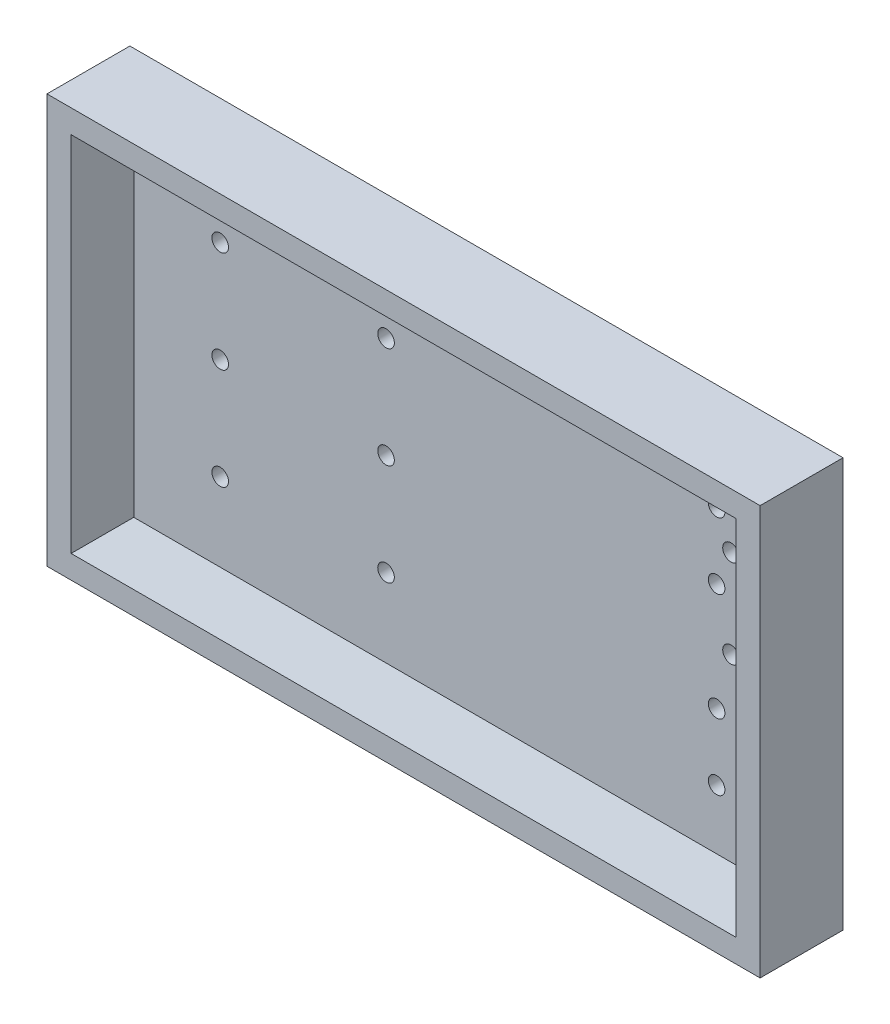
ISO-10303-21;
HEADER;
FILE_DESCRIPTION(('STEP AP214'),'2;1');
FILE_NAME('part.step','',(''),(''),'','','');
FILE_SCHEMA(('AUTOMOTIVE_DESIGN { 1 0 10303 214 1 1 1 1 }'));
ENDSEC;
DATA;
#1=APPLICATION_CONTEXT('core data for automotive mechanical design processes');
#2=APPLICATION_PROTOCOL_DEFINITION('international standard','automotive_design',2000,#1);
#3=PRODUCT_CONTEXT('',#1,'mechanical');
#4=PRODUCT('Part','Part','',(#3));
#5=PRODUCT_RELATED_PRODUCT_CATEGORY('part','',(#4));
#6=PRODUCT_DEFINITION_FORMATION('','',#4);
#7=PRODUCT_DEFINITION_CONTEXT('part definition',#1,'design');
#8=PRODUCT_DEFINITION('design','',#6,#7);
#9=PRODUCT_DEFINITION_SHAPE('','',#8);
#10=(LENGTH_UNIT() NAMED_UNIT(*) SI_UNIT(.MILLI.,.METRE.));
#11=(NAMED_UNIT(*) PLANE_ANGLE_UNIT() SI_UNIT($,.RADIAN.));
#12=(NAMED_UNIT(*) SI_UNIT($,.STERADIAN.) SOLID_ANGLE_UNIT());
#13=UNCERTAINTY_MEASURE_WITH_UNIT(LENGTH_MEASURE(1.E-05),#10,'distance_accuracy_value','');
#14=(GEOMETRIC_REPRESENTATION_CONTEXT(3) GLOBAL_UNCERTAINTY_ASSIGNED_CONTEXT((#13)) GLOBAL_UNIT_ASSIGNED_CONTEXT((#10,
#11,#12)) REPRESENTATION_CONTEXT('',''));
#15=CARTESIAN_POINT('',(0.,0.,0.));
#16=DIRECTION('',(0.,0.,1.));
#17=DIRECTION('',(1.,0.,0.));
#18=AXIS2_PLACEMENT_3D('',#15,#16,#17);
#19=CARTESIAN_POINT('',(50.3,37.,-29.));
#20=DIRECTION('',(0.,0.,-1.));
#21=DIRECTION('',(-1.,0.,0.));
#22=AXIS2_PLACEMENT_3D('',#19,#20,#21);
#23=CYLINDRICAL_SURFACE('',#22,1.5);
#24=CARTESIAN_POINT('',(50.3,37.,-39.));
#25=DIRECTION('',(0.,0.,-1.));
#26=DIRECTION('',(-1.,0.,0.));
#27=AXIS2_PLACEMENT_3D('',#24,#25,#26);
#28=CIRCLE('',#27,1.5);
#29=CARTESIAN_POINT('',(48.8,37.,-39.));
#30=VERTEX_POINT('',#29);
#31=EDGE_CURVE('E215',#30,#30,#28,.T.);
#32=ORIENTED_EDGE('',*,*,#31,.T.);
#33=EDGE_LOOP('',(#32));
#34=FACE_BOUND('',#33,.T.);
#35=CARTESIAN_POINT('',(50.3,37.,-35.035));
#36=DIRECTION('',(0.,0.,1.));
#37=DIRECTION('',(1.,0.,0.));
#38=AXIS2_PLACEMENT_3D('',#35,#36,#37);
#39=CIRCLE('',#38,1.5);
#40=CARTESIAN_POINT('',(51.8,37.,-35.035));
#41=VERTEX_POINT('',#40);
#42=EDGE_CURVE('E187',#41,#41,#39,.F.);
#43=ORIENTED_EDGE('',*,*,#42,.F.);
#44=EDGE_LOOP('',(#43));
#45=FACE_BOUND('',#44,.T.);
#46=ADVANCED_FACE('F32',(#34,#45),#23,.F.);
#47=CARTESIAN_POINT('',(110.1,46.75,-29.));
#48=DIRECTION('',(0.,0.,-1.));
#49=DIRECTION('',(-1.,0.,0.));
#50=AXIS2_PLACEMENT_3D('',#47,#48,#49);
#51=CYLINDRICAL_SURFACE('',#50,1.5);
#52=CARTESIAN_POINT('',(110.1,46.75,-39.));
#53=DIRECTION('',(0.,0.,-1.));
#54=DIRECTION('',(-1.,0.,0.));
#55=AXIS2_PLACEMENT_3D('',#52,#53,#54);
#56=CIRCLE('',#55,1.5);
#57=CARTESIAN_POINT('',(108.6,46.75,-39.));
#58=VERTEX_POINT('',#57);
#59=EDGE_CURVE('E194',#58,#58,#56,.T.);
#60=ORIENTED_EDGE('',*,*,#59,.T.);
#61=EDGE_LOOP('',(#60));
#62=FACE_BOUND('',#61,.T.);
#63=CARTESIAN_POINT('',(110.1,46.75,-35.035));
#64=DIRECTION('',(0.,0.,1.));
#65=DIRECTION('',(1.,0.,0.));
#66=AXIS2_PLACEMENT_3D('',#63,#64,#65);
#67=CIRCLE('',#66,1.5);
#68=CARTESIAN_POINT('',(111.6,46.75,-35.035));
#69=VERTEX_POINT('',#68);
#70=EDGE_CURVE('E184',#69,#69,#67,.F.);
#71=ORIENTED_EDGE('',*,*,#70,.F.);
#72=EDGE_LOOP('',(#71));
#73=FACE_BOUND('',#72,.T.);
#74=ADVANCED_FACE('F264',(#62,#73),#51,.F.);
#75=CARTESIAN_POINT('',(110.1,15.25,-29.));
#76=DIRECTION('',(0.,0.,-1.));
#77=DIRECTION('',(-1.,0.,0.));
#78=AXIS2_PLACEMENT_3D('',#75,#76,#77);
#79=CYLINDRICAL_SURFACE('',#78,1.5);
#80=CARTESIAN_POINT('',(110.1,15.25,-39.));
#81=DIRECTION('',(0.,0.,-1.));
#82=DIRECTION('',(-1.,0.,0.));
#83=AXIS2_PLACEMENT_3D('',#80,#81,#82);
#84=CIRCLE('',#83,1.5);
#85=CARTESIAN_POINT('',(108.6,15.25,-39.));
#86=VERTEX_POINT('',#85);
#87=EDGE_CURVE('E193',#86,#86,#84,.T.);
#88=ORIENTED_EDGE('',*,*,#87,.T.);
#89=EDGE_LOOP('',(#88));
#90=FACE_BOUND('',#89,.T.);
#91=CARTESIAN_POINT('',(110.1,15.25,-35.035));
#92=DIRECTION('',(0.,0.,1.));
#93=DIRECTION('',(1.,0.,0.));
#94=AXIS2_PLACEMENT_3D('',#91,#92,#93);
#95=CIRCLE('',#94,1.5);
#96=CARTESIAN_POINT('',(111.6,15.25,-35.035));
#97=VERTEX_POINT('',#96);
#98=EDGE_CURVE('E181',#97,#97,#95,.F.);
#99=ORIENTED_EDGE('',*,*,#98,.F.);
#100=EDGE_LOOP('',(#99));
#101=FACE_BOUND('',#100,.T.);
#102=ADVANCED_FACE('F270',(#90,#101),#79,.F.);
#103=CARTESIAN_POINT('',(110.1,27.25,-29.));
#104=DIRECTION('',(0.,0.,-1.));
#105=DIRECTION('',(-1.,0.,0.));
#106=AXIS2_PLACEMENT_3D('',#103,#104,#105);
#107=CYLINDRICAL_SURFACE('',#106,1.5);
#108=CARTESIAN_POINT('',(110.1,27.25,-39.));
#109=DIRECTION('',(0.,0.,-1.));
#110=DIRECTION('',(-1.,0.,0.));
#111=AXIS2_PLACEMENT_3D('',#108,#109,#110);
#112=CIRCLE('',#111,1.5);
#113=CARTESIAN_POINT('',(108.6,27.25,-39.));
#114=VERTEX_POINT('',#113);
#115=EDGE_CURVE('E190',#114,#114,#112,.T.);
#116=ORIENTED_EDGE('',*,*,#115,.T.);
#117=EDGE_LOOP('',(#116));
#118=FACE_BOUND('',#117,.T.);
#119=CARTESIAN_POINT('',(110.1,27.25,-35.035));
#120=DIRECTION('',(0.,0.,1.));
#121=DIRECTION('',(1.,0.,0.));
#122=AXIS2_PLACEMENT_3D('',#119,#120,#121);
#123=CIRCLE('',#122,1.5);
#124=CARTESIAN_POINT('',(111.6,27.25,-35.035));
#125=VERTEX_POINT('',#124);
#126=EDGE_CURVE('E178',#125,#125,#123,.F.);
#127=ORIENTED_EDGE('',*,*,#126,.F.);
#128=EDGE_LOOP('',(#127));
#129=FACE_BOUND('',#128,.T.);
#130=ADVANCED_FACE('F354',(#118,#129),#107,.F.);
#131=CARTESIAN_POINT('',(50.3,55.35,-29.));
#132=DIRECTION('',(0.,0.,-1.));
#133=DIRECTION('',(-1.,0.,0.));
#134=AXIS2_PLACEMENT_3D('',#131,#132,#133);
#135=CYLINDRICAL_SURFACE('',#134,1.5);
#136=CARTESIAN_POINT('',(50.3,55.35,-39.));
#137=DIRECTION('',(0.,0.,-1.));
#138=DIRECTION('',(-1.,0.,0.));
#139=AXIS2_PLACEMENT_3D('',#136,#137,#138);
#140=CIRCLE('',#139,1.5);
#141=CARTESIAN_POINT('',(48.8,55.35,-39.));
#142=VERTEX_POINT('',#141);
#143=EDGE_CURVE('E212',#142,#142,#140,.T.);
#144=ORIENTED_EDGE('',*,*,#143,.T.);
#145=EDGE_LOOP('',(#144));
#146=FACE_BOUND('',#145,.T.);
#147=CARTESIAN_POINT('',(50.3,55.35,-35.035));
#148=DIRECTION('',(0.,0.,1.));
#149=DIRECTION('',(1.,0.,0.));
#150=AXIS2_PLACEMENT_3D('',#147,#148,#149);
#151=CIRCLE('',#150,1.5);
#152=CARTESIAN_POINT('',(51.8,55.35,-35.035));
#153=VERTEX_POINT('',#152);
#154=EDGE_CURVE('E175',#153,#153,#151,.F.);
#155=ORIENTED_EDGE('',*,*,#154,.F.);
#156=EDGE_LOOP('',(#155));
#157=FACE_BOUND('',#156,.T.);
#158=ADVANCED_FACE('F363',(#146,#157),#135,.F.);
#159=CARTESIAN_POINT('',(50.3,18.65,-29.));
#160=DIRECTION('',(0.,0.,-1.));
#161=DIRECTION('',(-1.,0.,0.));
#162=AXIS2_PLACEMENT_3D('',#159,#160,#161);
#163=CYLINDRICAL_SURFACE('',#162,1.5);
#164=CARTESIAN_POINT('',(50.3,18.65,-39.));
#165=DIRECTION('',(0.,0.,-1.));
#166=DIRECTION('',(-1.,0.,0.));
#167=AXIS2_PLACEMENT_3D('',#164,#165,#166);
#168=CIRCLE('',#167,1.5);
#169=CARTESIAN_POINT('',(48.8,18.65,-39.));
#170=VERTEX_POINT('',#169);
#171=EDGE_CURVE('E216',#170,#170,#168,.T.);
#172=ORIENTED_EDGE('',*,*,#171,.T.);
#173=EDGE_LOOP('',(#172));
#174=FACE_BOUND('',#173,.T.);
#175=CARTESIAN_POINT('',(50.3,18.65,-35.035));
#176=DIRECTION('',(0.,0.,1.));
#177=DIRECTION('',(1.,0.,0.));
#178=AXIS2_PLACEMENT_3D('',#175,#176,#177);
#179=CIRCLE('',#178,1.5);
#180=CARTESIAN_POINT('',(51.8,18.65,-35.035));
#181=VERTEX_POINT('',#180);
#182=EDGE_CURVE('E172',#181,#181,#179,.F.);
#183=ORIENTED_EDGE('',*,*,#182,.F.);
#184=EDGE_LOOP('',(#183));
#185=FACE_BOUND('',#184,.T.);
#186=ADVANCED_FACE('F372',(#174,#185),#163,.F.);
#187=CARTESIAN_POINT('',(20.3,55.35,-29.));
#188=DIRECTION('',(0.,0.,-1.));
#189=DIRECTION('',(-1.,0.,0.));
#190=AXIS2_PLACEMENT_3D('',#187,#188,#189);
#191=CYLINDRICAL_SURFACE('',#190,1.5);
#192=CARTESIAN_POINT('',(20.3,55.35,-39.));
#193=DIRECTION('',(0.,0.,-1.));
#194=DIRECTION('',(-1.,0.,0.));
#195=AXIS2_PLACEMENT_3D('',#192,#193,#194);
#196=CIRCLE('',#195,1.5);
#197=CARTESIAN_POINT('',(18.8,55.35,-39.));
#198=VERTEX_POINT('',#197);
#199=EDGE_CURVE('E219',#198,#198,#196,.T.);
#200=ORIENTED_EDGE('',*,*,#199,.T.);
#201=EDGE_LOOP('',(#200));
#202=FACE_BOUND('',#201,.T.);
#203=CARTESIAN_POINT('',(20.3,55.35,-35.035));
#204=DIRECTION('',(0.,0.,1.));
#205=DIRECTION('',(1.,0.,0.));
#206=AXIS2_PLACEMENT_3D('',#203,#204,#205);
#207=CIRCLE('',#206,1.5);
#208=CARTESIAN_POINT('',(21.8,55.35,-35.035));
#209=VERTEX_POINT('',#208);
#210=EDGE_CURVE('E169',#209,#209,#207,.F.);
#211=ORIENTED_EDGE('',*,*,#210,.F.);
#212=EDGE_LOOP('',(#211));
#213=FACE_BOUND('',#212,.T.);
#214=ADVANCED_FACE('F381',(#202,#213),#191,.F.);
#215=CARTESIAN_POINT('',(20.3,37.,-29.));
#216=DIRECTION('',(0.,0.,-1.));
#217=DIRECTION('',(-1.,0.,0.));
#218=AXIS2_PLACEMENT_3D('',#215,#216,#217);
#219=CYLINDRICAL_SURFACE('',#218,1.5);
#220=CARTESIAN_POINT('',(20.3,37.,-39.));
#221=DIRECTION('',(0.,0.,-1.));
#222=DIRECTION('',(-1.,0.,0.));
#223=AXIS2_PLACEMENT_3D('',#220,#221,#222);
#224=CIRCLE('',#223,1.5);
#225=CARTESIAN_POINT('',(18.8,37.,-39.));
#226=VERTEX_POINT('',#225);
#227=EDGE_CURVE('E203',#226,#226,#224,.T.);
#228=ORIENTED_EDGE('',*,*,#227,.T.);
#229=EDGE_LOOP('',(#228));
#230=FACE_BOUND('',#229,.T.);
#231=CARTESIAN_POINT('',(20.3,37.,-35.035));
#232=DIRECTION('',(0.,0.,1.));
#233=DIRECTION('',(1.,0.,0.));
#234=AXIS2_PLACEMENT_3D('',#231,#232,#233);
#235=CIRCLE('',#234,1.5);
#236=CARTESIAN_POINT('',(21.8,37.,-35.035));
#237=VERTEX_POINT('',#236);
#238=EDGE_CURVE('E166',#237,#237,#235,.F.);
#239=ORIENTED_EDGE('',*,*,#238,.F.);
#240=EDGE_LOOP('',(#239));
#241=FACE_BOUND('',#240,.T.);
#242=ADVANCED_FACE('F276',(#230,#241),#219,.F.);
#243=CARTESIAN_POINT('',(20.3,18.65,-29.));
#244=DIRECTION('',(0.,0.,-1.));
#245=DIRECTION('',(-1.,0.,0.));
#246=AXIS2_PLACEMENT_3D('',#243,#244,#245);
#247=CYLINDRICAL_SURFACE('',#246,1.5);
#248=CARTESIAN_POINT('',(20.3,18.65,-39.));
#249=DIRECTION('',(0.,0.,-1.));
#250=DIRECTION('',(-1.,0.,0.));
#251=AXIS2_PLACEMENT_3D('',#248,#249,#250);
#252=CIRCLE('',#251,1.5);
#253=CARTESIAN_POINT('',(18.8,18.65,-39.));
#254=VERTEX_POINT('',#253);
#255=EDGE_CURVE('E200',#254,#254,#252,.T.);
#256=ORIENTED_EDGE('',*,*,#255,.T.);
#257=EDGE_LOOP('',(#256));
#258=FACE_BOUND('',#257,.T.);
#259=CARTESIAN_POINT('',(20.3,18.65,-35.035));
#260=DIRECTION('',(0.,0.,1.));
#261=DIRECTION('',(1.,0.,0.));
#262=AXIS2_PLACEMENT_3D('',#259,#260,#261);
#263=CIRCLE('',#262,1.5);
#264=CARTESIAN_POINT('',(21.8,18.65,-35.035));
#265=VERTEX_POINT('',#264);
#266=EDGE_CURVE('E163',#265,#265,#263,.F.);
#267=ORIENTED_EDGE('',*,*,#266,.F.);
#268=EDGE_LOOP('',(#267));
#269=FACE_BOUND('',#268,.T.);
#270=ADVANCED_FACE('F397',(#258,#269),#247,.F.);
#271=CARTESIAN_POINT('',(112.7,37.,-29.));
#272=DIRECTION('',(0.,0.,-1.));
#273=DIRECTION('',(-1.,0.,0.));
#274=AXIS2_PLACEMENT_3D('',#271,#272,#273);
#275=CYLINDRICAL_SURFACE('',#274,1.5);
#276=CARTESIAN_POINT('',(112.7,37.,-39.));
#277=DIRECTION('',(0.,0.,-1.));
#278=DIRECTION('',(-1.,0.,0.));
#279=AXIS2_PLACEMENT_3D('',#276,#277,#278);
#280=CIRCLE('',#279,1.5);
#281=CARTESIAN_POINT('',(111.2,37.,-39.));
#282=VERTEX_POINT('',#281);
#283=EDGE_CURVE('E204',#282,#282,#280,.T.);
#284=ORIENTED_EDGE('',*,*,#283,.T.);
#285=EDGE_LOOP('',(#284));
#286=FACE_BOUND('',#285,.T.);
#287=CARTESIAN_POINT('',(112.7,37.,-35.035));
#288=DIRECTION('',(0.,0.,1.));
#289=DIRECTION('',(1.,0.,0.));
#290=AXIS2_PLACEMENT_3D('',#287,#288,#289);
#291=CIRCLE('',#290,1.5);
#292=CARTESIAN_POINT('',(114.2,37.,-35.035));
#293=VERTEX_POINT('',#292);
#294=EDGE_CURVE('E130',#293,#293,#291,.F.);
#295=ORIENTED_EDGE('',*,*,#294,.F.);
#296=EDGE_LOOP('',(#295));
#297=FACE_BOUND('',#296,.T.);
#298=ADVANCED_FACE('F405',(#286,#297),#275,.F.);
#299=CARTESIAN_POINT('',(112.7,53.,-29.));
#300=DIRECTION('',(0.,0.,-1.));
#301=DIRECTION('',(-1.,0.,0.));
#302=AXIS2_PLACEMENT_3D('',#299,#300,#301);
#303=CYLINDRICAL_SURFACE('',#302,1.5);
#304=CARTESIAN_POINT('',(112.7,53.,-39.));
#305=DIRECTION('',(0.,0.,-1.));
#306=DIRECTION('',(-1.,0.,0.));
#307=AXIS2_PLACEMENT_3D('',#304,#305,#306);
#308=CIRCLE('',#307,1.5);
#309=CARTESIAN_POINT('',(111.2,53.,-39.));
#310=VERTEX_POINT('',#309);
#311=EDGE_CURVE('E207',#310,#310,#308,.T.);
#312=ORIENTED_EDGE('',*,*,#311,.T.);
#313=EDGE_LOOP('',(#312));
#314=FACE_BOUND('',#313,.T.);
#315=CARTESIAN_POINT('',(112.7,53.,-35.035));
#316=DIRECTION('',(0.,0.,1.));
#317=DIRECTION('',(1.,0.,0.));
#318=AXIS2_PLACEMENT_3D('',#315,#316,#317);
#319=CIRCLE('',#318,1.5);
#320=CARTESIAN_POINT('',(114.2,53.,-35.035));
#321=VERTEX_POINT('',#320);
#322=EDGE_CURVE('E125',#321,#321,#319,.F.);
#323=ORIENTED_EDGE('',*,*,#322,.F.);
#324=EDGE_LOOP('',(#323));
#325=FACE_BOUND('',#324,.T.);
#326=ADVANCED_FACE('F414',(#314,#325),#303,.F.);
#327=CARTESIAN_POINT('',(110.1,58.75,-29.));
#328=DIRECTION('',(0.,0.,-1.));
#329=DIRECTION('',(-1.,0.,0.));
#330=AXIS2_PLACEMENT_3D('',#327,#328,#329);
#331=CYLINDRICAL_SURFACE('',#330,1.5);
#332=CARTESIAN_POINT('',(110.1,58.75,-39.));
#333=DIRECTION('',(0.,0.,-1.));
#334=DIRECTION('',(-1.,0.,0.));
#335=AXIS2_PLACEMENT_3D('',#332,#333,#334);
#336=CIRCLE('',#335,1.5);
#337=CARTESIAN_POINT('',(108.6,58.75,-39.));
#338=VERTEX_POINT('',#337);
#339=EDGE_CURVE('E197',#338,#338,#336,.T.);
#340=ORIENTED_EDGE('',*,*,#339,.T.);
#341=EDGE_LOOP('',(#340));
#342=FACE_BOUND('',#341,.T.);
#343=CARTESIAN_POINT('',(110.1,58.75,-35.035));
#344=DIRECTION('',(0.,0.,1.));
#345=DIRECTION('',(1.,0.,0.));
#346=AXIS2_PLACEMENT_3D('',#343,#344,#345);
#347=CIRCLE('',#346,1.5);
#348=CARTESIAN_POINT('',(111.6,58.75,-35.035));
#349=VERTEX_POINT('',#348);
#350=EDGE_CURVE('E123',#349,#349,#347,.F.);
#351=ORIENTED_EDGE('',*,*,#350,.F.);
#352=EDGE_LOOP('',(#351));
#353=FACE_BOUND('',#352,.T.);
#354=ADVANCED_FACE('F423',(#342,#353),#331,.F.);
#355=CARTESIAN_POINT('',(0.,0.,-39.));
#356=DIRECTION('',(-1.,0.,0.));
#357=DIRECTION('',(0.,0.,1.));
#358=AXIS2_PLACEMENT_3D('',#355,#356,#357);
#359=PLANE('',#358);
#360=DIRECTION('',(0.,1.,0.));
#361=VECTOR('',#360,1.);
#362=CARTESIAN_POINT('',(0.,-26.,-24.));
#363=LINE('',#362,#361);
#364=CARTESIAN_POINT('',(0.,0.,-24.));
#365=VERTEX_POINT('',#364);
#366=CARTESIAN_POINT('',(0.,74.,-24.));
#367=VERTEX_POINT('',#366);
#368=EDGE_CURVE('E47',#365,#367,#363,.T.);
#369=ORIENTED_EDGE('',*,*,#368,.T.);
#370=DIRECTION('',(0.,0.,1.));
#371=VECTOR('',#370,1.);
#372=CARTESIAN_POINT('',(0.,74.,-39.));
#373=LINE('',#372,#371);
#374=CARTESIAN_POINT('',(0.,74.,-39.));
#375=VERTEX_POINT('',#374);
#376=EDGE_CURVE('E40',#375,#367,#373,.T.);
#377=ORIENTED_EDGE('',*,*,#376,.F.);
#378=DIRECTION('',(0.,-1.,0.));
#379=VECTOR('',#378,1.);
#380=CARTESIAN_POINT('',(0.,0.,-39.));
#381=LINE('',#380,#379);
#382=CARTESIAN_POINT('',(0.,0.,-39.));
#383=VERTEX_POINT('',#382);
#384=EDGE_CURVE('E226',#375,#383,#381,.T.);
#385=ORIENTED_EDGE('',*,*,#384,.T.);
#386=DIRECTION('',(0.,0.,1.));
#387=VECTOR('',#386,1.);
#388=CARTESIAN_POINT('',(0.,0.,-39.));
#389=LINE('',#388,#387);
#390=EDGE_CURVE('E117',#383,#365,#389,.T.);
#391=ORIENTED_EDGE('',*,*,#390,.T.);
#392=EDGE_LOOP('',(#369,#377,#385,#391));
#393=FACE_BOUND('',#392,.T.);
#394=ADVANCED_FACE('F34',(#393),#359,.T.);
#395=CARTESIAN_POINT('',(0.,74.,-39.));
#396=DIRECTION('',(0.,1.,0.));
#397=DIRECTION('',(0.,0.,1.));
#398=AXIS2_PLACEMENT_3D('',#395,#396,#397);
#399=PLANE('',#398);
#400=DIRECTION('',(-1.,0.,0.));
#401=VECTOR('',#400,1.);
#402=CARTESIAN_POINT('',(0.,74.,-24.));
#403=LINE('',#402,#401);
#404=CARTESIAN_POINT('',(129.,74.,-24.));
#405=VERTEX_POINT('',#404);
#406=EDGE_CURVE('E97',#405,#367,#403,.T.);
#407=ORIENTED_EDGE('',*,*,#406,.F.);
#408=DIRECTION('',(0.,0.,1.));
#409=VECTOR('',#408,1.);
#410=CARTESIAN_POINT('',(129.,74.,-39.));
#411=LINE('',#410,#409);
#412=CARTESIAN_POINT('',(129.,74.,-39.));
#413=VERTEX_POINT('',#412);
#414=EDGE_CURVE('E107',#413,#405,#411,.T.);
#415=ORIENTED_EDGE('',*,*,#414,.F.);
#416=DIRECTION('',(-1.,0.,0.));
#417=VECTOR('',#416,1.);
#418=CARTESIAN_POINT('',(0.,74.,-39.));
#419=LINE('',#418,#417);
#420=EDGE_CURVE('E122',#413,#375,#419,.T.);
#421=ORIENTED_EDGE('',*,*,#420,.T.);
#422=ORIENTED_EDGE('',*,*,#376,.T.);
#423=EDGE_LOOP('',(#407,#415,#421,#422));
#424=FACE_BOUND('',#423,.T.);
#425=ADVANCED_FACE('F105',(#424),#399,.T.);
#426=CARTESIAN_POINT('',(129.,0.,-39.));
#427=DIRECTION('',(1.,0.,0.));
#428=DIRECTION('',(0.,0.,-1.));
#429=AXIS2_PLACEMENT_3D('',#426,#427,#428);
#430=PLANE('',#429);
#431=DIRECTION('',(0.,1.,0.));
#432=VECTOR('',#431,1.);
#433=CARTESIAN_POINT('',(129.,-26.,-24.));
#434=LINE('',#433,#432);
#435=CARTESIAN_POINT('',(129.,0.,-24.));
#436=VERTEX_POINT('',#435);
#437=EDGE_CURVE('E94',#436,#405,#434,.T.);
#438=ORIENTED_EDGE('',*,*,#437,.F.);
#439=DIRECTION('',(0.,0.,1.));
#440=VECTOR('',#439,1.);
#441=CARTESIAN_POINT('',(129.,0.,-39.));
#442=LINE('',#441,#440);
#443=CARTESIAN_POINT('',(129.,0.,-39.));
#444=VERTEX_POINT('',#443);
#445=EDGE_CURVE('E114',#444,#436,#442,.T.);
#446=ORIENTED_EDGE('',*,*,#445,.F.);
#447=DIRECTION('',(0.,1.,0.));
#448=VECTOR('',#447,1.);
#449=CARTESIAN_POINT('',(129.,0.,-39.));
#450=LINE('',#449,#448);
#451=EDGE_CURVE('E112',#444,#413,#450,.T.);
#452=ORIENTED_EDGE('',*,*,#451,.T.);
#453=ORIENTED_EDGE('',*,*,#414,.T.);
#454=EDGE_LOOP('',(#438,#446,#452,#453));
#455=FACE_BOUND('',#454,.T.);
#456=ADVANCED_FACE('F110',(#455),#430,.T.);
#457=CARTESIAN_POINT('',(0.,0.,-39.));
#458=DIRECTION('',(0.,-1.,0.));
#459=DIRECTION('',(0.,0.,-1.));
#460=AXIS2_PLACEMENT_3D('',#457,#458,#459);
#461=PLANE('',#460);
#462=DIRECTION('',(1.,0.,0.));
#463=VECTOR('',#462,1.);
#464=CARTESIAN_POINT('',(0.,0.,-24.));
#465=LINE('',#464,#463);
#466=EDGE_CURVE('E98',#365,#436,#465,.T.);
#467=ORIENTED_EDGE('',*,*,#466,.F.);
#468=ORIENTED_EDGE('',*,*,#390,.F.);
#469=DIRECTION('',(1.,0.,0.));
#470=VECTOR('',#469,1.);
#471=CARTESIAN_POINT('',(0.,0.,-39.));
#472=LINE('',#471,#470);
#473=EDGE_CURVE('E229',#383,#444,#472,.T.);
#474=ORIENTED_EDGE('',*,*,#473,.T.);
#475=ORIENTED_EDGE('',*,*,#445,.T.);
#476=EDGE_LOOP('',(#467,#468,#474,#475));
#477=FACE_BOUND('',#476,.T.);
#478=ADVANCED_FACE('F280',(#477),#461,.T.);
#479=CARTESIAN_POINT('',(0.,0.,-39.));
#480=DIRECTION('',(0.,0.,-1.));
#481=DIRECTION('',(-1.,0.,0.));
#482=AXIS2_PLACEMENT_3D('',#479,#480,#481);
#483=PLANE('',#482);
#484=ORIENTED_EDGE('',*,*,#339,.F.);
#485=EDGE_LOOP('',(#484));
#486=FACE_BOUND('',#485,.T.);
#487=ORIENTED_EDGE('',*,*,#311,.F.);
#488=EDGE_LOOP('',(#487));
#489=FACE_BOUND('',#488,.T.);
#490=ORIENTED_EDGE('',*,*,#283,.F.);
#491=EDGE_LOOP('',(#490));
#492=FACE_BOUND('',#491,.T.);
#493=ORIENTED_EDGE('',*,*,#255,.F.);
#494=EDGE_LOOP('',(#493));
#495=FACE_BOUND('',#494,.T.);
#496=ORIENTED_EDGE('',*,*,#227,.F.);
#497=EDGE_LOOP('',(#496));
#498=FACE_BOUND('',#497,.T.);
#499=ORIENTED_EDGE('',*,*,#199,.F.);
#500=EDGE_LOOP('',(#499));
#501=FACE_BOUND('',#500,.T.);
#502=ORIENTED_EDGE('',*,*,#171,.F.);
#503=EDGE_LOOP('',(#502));
#504=FACE_BOUND('',#503,.T.);
#505=ORIENTED_EDGE('',*,*,#143,.F.);
#506=EDGE_LOOP('',(#505));
#507=FACE_BOUND('',#506,.T.);
#508=ORIENTED_EDGE('',*,*,#115,.F.);
#509=EDGE_LOOP('',(#508));
#510=FACE_BOUND('',#509,.T.);
#511=ORIENTED_EDGE('',*,*,#87,.F.);
#512=EDGE_LOOP('',(#511));
#513=FACE_BOUND('',#512,.T.);
#514=ORIENTED_EDGE('',*,*,#59,.F.);
#515=EDGE_LOOP('',(#514));
#516=FACE_BOUND('',#515,.T.);
#517=ORIENTED_EDGE('',*,*,#31,.F.);
#518=EDGE_LOOP('',(#517));
#519=FACE_BOUND('',#518,.T.);
#520=ORIENTED_EDGE('',*,*,#384,.F.);
#521=ORIENTED_EDGE('',*,*,#420,.F.);
#522=ORIENTED_EDGE('',*,*,#451,.F.);
#523=ORIENTED_EDGE('',*,*,#473,.F.);
#524=EDGE_LOOP('',(#520,#521,#522,#523));
#525=FACE_BOUND('',#524,.T.);
#526=ADVANCED_FACE('F234',(#486,#489,#492,#495,#498,#501,#504,#507,#510,#513,#516,#519,#525),
#483,.T.);
#527=CARTESIAN_POINT('',(65.5,38.,-35.035));
#528=DIRECTION('',(0.,0.,1.));
#529=DIRECTION('',(1.,0.,0.));
#530=AXIS2_PLACEMENT_3D('',#527,#528,#529);
#531=PLANE('',#530);
#532=DIRECTION('',(0.,1.,0.));
#533=VECTOR('',#532,1.);
#534=CARTESIAN_POINT('',(124.330201476941,38.,-35.035));
#535=LINE('',#534,#533);
#536=CARTESIAN_POINT('',(124.330201476941,4.48317304482346,-35.035));
#537=VERTEX_POINT('',#536);
#538=CARTESIAN_POINT('',(124.330201476941,69.5058269551765,-35.035));
#539=VERTEX_POINT('',#538);
#540=EDGE_CURVE('E144',#537,#539,#535,.T.);
#541=ORIENTED_EDGE('',*,*,#540,.T.);
#542=DIRECTION('',(-1.,0.,0.));
#543=VECTOR('',#542,1.);
#544=CARTESIAN_POINT('',(65.5,69.5058269551765,-35.035));
#545=LINE('',#544,#543);
#546=CARTESIAN_POINT('',(4.66479852305876,69.5058269551765,-35.035));
#547=VERTEX_POINT('',#546);
#548=EDGE_CURVE('E147',#539,#547,#545,.T.);
#549=ORIENTED_EDGE('',*,*,#548,.T.);
#550=DIRECTION('',(0.,-1.,0.));
#551=VECTOR('',#550,1.);
#552=CARTESIAN_POINT('',(4.66479852305876,38.,-35.035));
#553=LINE('',#552,#551);
#554=CARTESIAN_POINT('',(4.66479852305876,4.48317304482346,-35.035));
#555=VERTEX_POINT('',#554);
#556=EDGE_CURVE('E154',#547,#555,#553,.T.);
#557=ORIENTED_EDGE('',*,*,#556,.T.);
#558=DIRECTION('',(1.,0.,0.));
#559=VECTOR('',#558,1.);
#560=CARTESIAN_POINT('',(65.5,4.48317304482346,-35.035));
#561=LINE('',#560,#559);
#562=EDGE_CURVE('E150',#555,#537,#561,.T.);
#563=ORIENTED_EDGE('',*,*,#562,.T.);
#564=EDGE_LOOP('',(#541,#549,#557,#563));
#565=FACE_BOUND('',#564,.T.);
#566=ORIENTED_EDGE('',*,*,#350,.T.);
#567=EDGE_LOOP('',(#566));
#568=FACE_BOUND('',#567,.T.);
#569=ORIENTED_EDGE('',*,*,#322,.T.);
#570=EDGE_LOOP('',(#569));
#571=FACE_BOUND('',#570,.T.);
#572=ORIENTED_EDGE('',*,*,#294,.T.);
#573=EDGE_LOOP('',(#572));
#574=FACE_BOUND('',#573,.T.);
#575=ORIENTED_EDGE('',*,*,#266,.T.);
#576=EDGE_LOOP('',(#575));
#577=FACE_BOUND('',#576,.T.);
#578=ORIENTED_EDGE('',*,*,#238,.T.);
#579=EDGE_LOOP('',(#578));
#580=FACE_BOUND('',#579,.T.);
#581=ORIENTED_EDGE('',*,*,#210,.T.);
#582=EDGE_LOOP('',(#581));
#583=FACE_BOUND('',#582,.T.);
#584=ORIENTED_EDGE('',*,*,#182,.T.);
#585=EDGE_LOOP('',(#584));
#586=FACE_BOUND('',#585,.T.);
#587=ORIENTED_EDGE('',*,*,#154,.T.);
#588=EDGE_LOOP('',(#587));
#589=FACE_BOUND('',#588,.T.);
#590=ORIENTED_EDGE('',*,*,#126,.T.);
#591=EDGE_LOOP('',(#590));
#592=FACE_BOUND('',#591,.T.);
#593=ORIENTED_EDGE('',*,*,#98,.T.);
#594=EDGE_LOOP('',(#593));
#595=FACE_BOUND('',#594,.T.);
#596=ORIENTED_EDGE('',*,*,#70,.T.);
#597=EDGE_LOOP('',(#596));
#598=FACE_BOUND('',#597,.T.);
#599=ORIENTED_EDGE('',*,*,#42,.T.);
#600=EDGE_LOOP('',(#599));
#601=FACE_BOUND('',#600,.T.);
#602=ADVANCED_FACE('F249',(#565,#568,#571,#574,#577,#580,#583,#586,#589,#592,#595,#598,#601),
#531,.T.);
#603=CARTESIAN_POINT('',(125.249,3.56162499999998,0.));
#604=DIRECTION('',(0.999656297737812,0.,-0.0262161475646596));
#605=DIRECTION('',(-0.0262161475646596,0.,-0.999656297737812));
#606=AXIS2_PLACEMENT_3D('',#603,#604,#605);
#607=PLANE('',#606);
#608=DIRECTION('',(0.0262070892609787,-0.0262855144657497,0.99931089266641));
#609=VECTOR('',#608,1.);
#610=CARTESIAN_POINT('',(125.16579919255,3.64507478742238,-3.17255656801247));
#611=LINE('',#610,#609);
#612=CARTESIAN_POINT('',(124.619596130915,4.19291237193558,-24.));
#613=VERTEX_POINT('',#612);
#614=EDGE_CURVE('E126',#537,#613,#611,.T.);
#615=ORIENTED_EDGE('',*,*,#614,.T.);
#616=DIRECTION('',(0.,1.,0.));
#617=VECTOR('',#616,1.);
#618=CARTESIAN_POINT('',(124.619596130915,3.56162499999998,-24.));
#619=LINE('',#618,#617);
#620=CARTESIAN_POINT('',(124.619596130915,69.7960876280644,-24.));
#621=VERTEX_POINT('',#620);
#622=EDGE_CURVE('E242',#613,#621,#619,.T.);
#623=ORIENTED_EDGE('',*,*,#622,.T.);
#624=DIRECTION('',(0.0262070892609787,0.0262855144657497,0.99931089266641));
#625=VECTOR('',#624,1.);
#626=CARTESIAN_POINT('',(125.203349391952,70.3815877816536,-1.74071791891774));
#627=LINE('',#626,#625);
#628=EDGE_CURVE('E148',#539,#621,#627,.T.);
#629=ORIENTED_EDGE('',*,*,#628,.F.);
#630=ORIENTED_EDGE('',*,*,#540,.F.);
#631=EDGE_LOOP('',(#615,#623,#629,#630));
#632=FACE_BOUND('',#631,.T.);
#633=ADVANCED_FACE('F243',(#632),#607,.F.);
#634=CARTESIAN_POINT('',(3.74600000000005,3.56162499999998,0.));
#635=DIRECTION('',(0.,-0.999654238657361,-0.0262945457152618));
#636=DIRECTION('',(0.,0.0262945457152618,-0.999654238657361));
#637=AXIS2_PLACEMENT_3D('',#634,#635,#636);
#638=PLANE('',#637);
#639=DIRECTION('',(-0.0262070892609787,-0.0262855144657497,0.99931089266641));
#640=VECTOR('',#639,1.);
#641=CARTESIAN_POINT('',(3.7916506080481,3.60741221834644,-1.74071791891774));
#642=LINE('',#641,#640);
#643=CARTESIAN_POINT('',(4.37540386908551,4.19291237193559,-24.));
#644=VERTEX_POINT('',#643);
#645=EDGE_CURVE('E133',#555,#644,#642,.T.);
#646=ORIENTED_EDGE('',*,*,#645,.T.);
#647=DIRECTION('',(1.,0.,0.));
#648=VECTOR('',#647,1.);
#649=CARTESIAN_POINT('',(3.74600000000005,4.19291237193558,-24.));
#650=LINE('',#649,#648);
#651=EDGE_CURVE('E238',#644,#613,#650,.T.);
#652=ORIENTED_EDGE('',*,*,#651,.T.);
#653=ORIENTED_EDGE('',*,*,#614,.F.);
#654=ORIENTED_EDGE('',*,*,#562,.F.);
#655=EDGE_LOOP('',(#646,#652,#653,#654));
#656=FACE_BOUND('',#655,.T.);
#657=ADVANCED_FACE('F252',(#656),#638,.F.);
#658=CARTESIAN_POINT('',(3.74600000000004,70.427375,0.));
#659=DIRECTION('',(-0.999656297737812,0.,-0.0262161475646596));
#660=DIRECTION('',(-0.0262161475646596,0.,0.999656297737812));
#661=AXIS2_PLACEMENT_3D('',#658,#659,#660);
#662=PLANE('',#661);
#663=DIRECTION('',(-0.0262070892609787,0.0262855144657497,0.99931089266641));
#664=VECTOR('',#663,1.);
#665=CARTESIAN_POINT('',(3.82920080745002,70.3439252125776,-3.17255656801247));
#666=LINE('',#665,#664);
#667=CARTESIAN_POINT('',(4.37540386908551,69.7960876280644,-24.));
#668=VERTEX_POINT('',#667);
#669=EDGE_CURVE('E139',#547,#668,#666,.T.);
#670=ORIENTED_EDGE('',*,*,#669,.T.);
#671=DIRECTION('',(0.,-1.,0.));
#672=VECTOR('',#671,1.);
#673=CARTESIAN_POINT('',(4.3754038690855,70.427375,-24.));
#674=LINE('',#673,#672);
#675=EDGE_CURVE('E55',#668,#644,#674,.T.);
#676=ORIENTED_EDGE('',*,*,#675,.T.);
#677=ORIENTED_EDGE('',*,*,#645,.F.);
#678=ORIENTED_EDGE('',*,*,#556,.F.);
#679=EDGE_LOOP('',(#670,#676,#677,#678));
#680=FACE_BOUND('',#679,.T.);
#681=ADVANCED_FACE('F254',(#680),#662,.F.);
#682=CARTESIAN_POINT('',(125.249,70.427375,0.));
#683=DIRECTION('',(0.,0.999654238657361,-0.0262945457152619));
#684=DIRECTION('',(0.,0.0262945457152619,0.999654238657361));
#685=AXIS2_PLACEMENT_3D('',#682,#683,#684);
#686=PLANE('',#685);
#687=ORIENTED_EDGE('',*,*,#628,.T.);
#688=DIRECTION('',(-1.,0.,0.));
#689=VECTOR('',#688,1.);
#690=CARTESIAN_POINT('',(125.249,69.7960876280644,-24.));
#691=LINE('',#690,#689);
#692=EDGE_CURVE('E11',#621,#668,#691,.T.);
#693=ORIENTED_EDGE('',*,*,#692,.T.);
#694=ORIENTED_EDGE('',*,*,#669,.F.);
#695=ORIENTED_EDGE('',*,*,#548,.F.);
#696=EDGE_LOOP('',(#687,#693,#694,#695));
#697=FACE_BOUND('',#696,.T.);
#698=ADVANCED_FACE('F246',(#697),#686,.F.);
#699=CARTESIAN_POINT('',(0.,-26.,-24.));
#700=DIRECTION('',(0.,0.,-1.));
#701=DIRECTION('',(-1.,0.,0.));
#702=AXIS2_PLACEMENT_3D('',#699,#700,#701);
#703=PLANE('',#702);
#704=ORIENTED_EDGE('',*,*,#466,.T.);
#705=ORIENTED_EDGE('',*,*,#437,.T.);
#706=ORIENTED_EDGE('',*,*,#406,.T.);
#707=ORIENTED_EDGE('',*,*,#368,.F.);
#708=EDGE_LOOP('',(#704,#705,#706,#707));
#709=FACE_BOUND('',#708,.T.);
#710=ORIENTED_EDGE('',*,*,#651,.F.);
#711=ORIENTED_EDGE('',*,*,#675,.F.);
#712=ORIENTED_EDGE('',*,*,#692,.F.);
#713=ORIENTED_EDGE('',*,*,#622,.F.);
#714=EDGE_LOOP('',(#710,#711,#712,#713));
#715=FACE_BOUND('',#714,.T.);
#716=ADVANCED_FACE('F96',(#709,#715),#703,.F.);
#717=CLOSED_SHELL('',(#46,#74,#102,#130,#158,#186,#214,#242,#270,#298,#326,#354,#394,#425,#456,
#478,#526,#602,#633,#657,#681,#698,#716));
#718=MANIFOLD_SOLID_BREP('B2',#717);
#719=ADVANCED_BREP_SHAPE_REPRESENTATION('',(#18,#718),#14);
#720=SHAPE_DEFINITION_REPRESENTATION(#9,#719);
ENDSEC;
END-ISO-10303-21;
